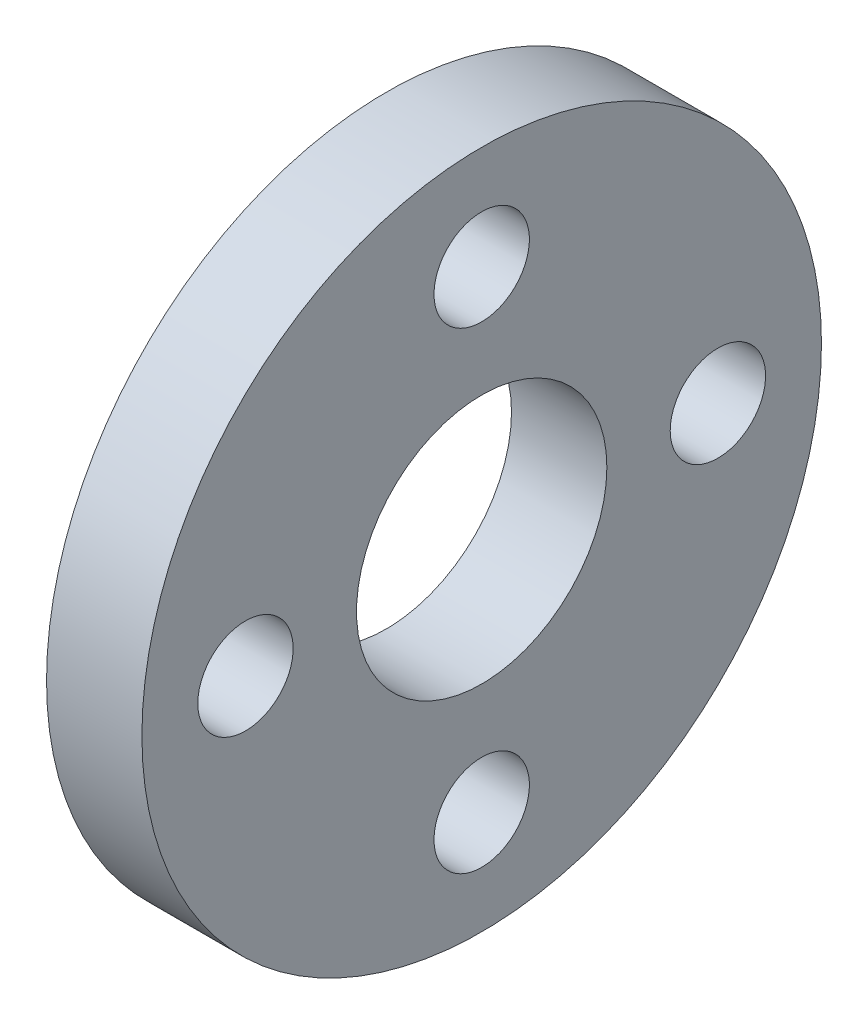
ISO-10303-21;
HEADER;
FILE_DESCRIPTION(('STEP AP214'),'2;1');
FILE_NAME('part.step','',(''),(''),'','','');
FILE_SCHEMA(('AUTOMOTIVE_DESIGN { 1 0 10303 214 1 1 1 1 }'));
ENDSEC;
DATA;
#1=APPLICATION_CONTEXT('core data for automotive mechanical design processes');
#2=APPLICATION_PROTOCOL_DEFINITION('international standard','automotive_design',2000,#1);
#3=PRODUCT_CONTEXT('',#1,'mechanical');
#4=PRODUCT('Part','Part','',(#3));
#5=PRODUCT_RELATED_PRODUCT_CATEGORY('part','',(#4));
#6=PRODUCT_DEFINITION_FORMATION('','',#4);
#7=PRODUCT_DEFINITION_CONTEXT('part definition',#1,'design');
#8=PRODUCT_DEFINITION('design','',#6,#7);
#9=PRODUCT_DEFINITION_SHAPE('','',#8);
#10=(LENGTH_UNIT() NAMED_UNIT(*) SI_UNIT(.MILLI.,.METRE.));
#11=(NAMED_UNIT(*) PLANE_ANGLE_UNIT() SI_UNIT($,.RADIAN.));
#12=(NAMED_UNIT(*) SI_UNIT($,.STERADIAN.) SOLID_ANGLE_UNIT());
#13=UNCERTAINTY_MEASURE_WITH_UNIT(LENGTH_MEASURE(1.E-05),#10,'distance_accuracy_value','');
#14=(GEOMETRIC_REPRESENTATION_CONTEXT(3) GLOBAL_UNCERTAINTY_ASSIGNED_CONTEXT((#13)) GLOBAL_UNIT_ASSIGNED_CONTEXT((#10,
#11,#12)) REPRESENTATION_CONTEXT('',''));
#15=CARTESIAN_POINT('',(0.,0.,0.));
#16=DIRECTION('',(0.,0.,1.));
#17=DIRECTION('',(1.,0.,0.));
#18=AXIS2_PLACEMENT_3D('',#15,#16,#17);
#19=CARTESIAN_POINT('',(16.,0.,39.625));
#20=DIRECTION('',(-1.,0.,0.));
#21=DIRECTION('',(0.,0.,1.));
#22=AXIS2_PLACEMENT_3D('',#19,#20,#21);
#23=CYLINDRICAL_SURFACE('',#22,8.);
#24=CARTESIAN_POINT('',(16.,0.,39.625));
#25=DIRECTION('',(-1.,0.,0.));
#26=DIRECTION('',(0.,0.,1.));
#27=AXIS2_PLACEMENT_3D('',#24,#25,#26);
#28=CIRCLE('',#27,8.);
#29=CARTESIAN_POINT('',(16.,0.,47.625));
#30=VERTEX_POINT('',#29);
#31=EDGE_CURVE('E39',#30,#30,#28,.T.);
#32=ORIENTED_EDGE('',*,*,#31,.F.);
#33=EDGE_LOOP('',(#32));
#34=FACE_BOUND('',#33,.T.);
#35=CARTESIAN_POINT('',(0.,0.,39.625));
#36=DIRECTION('',(-1.,0.,0.));
#37=DIRECTION('',(0.,0.,1.));
#38=AXIS2_PLACEMENT_3D('',#35,#36,#37);
#39=CIRCLE('',#38,8.);
#40=CARTESIAN_POINT('',(0.,0.,47.625));
#41=VERTEX_POINT('',#40);
#42=EDGE_CURVE('E16',#41,#41,#39,.F.);
#43=ORIENTED_EDGE('',*,*,#42,.F.);
#44=EDGE_LOOP('',(#43));
#45=FACE_BOUND('',#44,.T.);
#46=ADVANCED_FACE('F13',(#34,#45),#23,.F.);
#47=CARTESIAN_POINT('',(16.,-39.625,0.));
#48=DIRECTION('',(-1.,0.,0.));
#49=DIRECTION('',(0.,0.,1.));
#50=AXIS2_PLACEMENT_3D('',#47,#48,#49);
#51=CYLINDRICAL_SURFACE('',#50,8.00000000000001);
#52=CARTESIAN_POINT('',(16.,-39.625,0.));
#53=DIRECTION('',(-1.,0.,0.));
#54=DIRECTION('',(0.,0.,1.));
#55=AXIS2_PLACEMENT_3D('',#52,#53,#54);
#56=CIRCLE('',#55,8.00000000000001);
#57=CARTESIAN_POINT('',(16.,-39.625,8.00000000000001));
#58=VERTEX_POINT('',#57);
#59=EDGE_CURVE('E36',#58,#58,#56,.T.);
#60=ORIENTED_EDGE('',*,*,#59,.F.);
#61=EDGE_LOOP('',(#60));
#62=FACE_BOUND('',#61,.T.);
#63=CARTESIAN_POINT('',(0.,-39.625,0.));
#64=DIRECTION('',(-1.,0.,0.));
#65=DIRECTION('',(0.,0.,1.));
#66=AXIS2_PLACEMENT_3D('',#63,#64,#65);
#67=CIRCLE('',#66,8.00000000000001);
#68=CARTESIAN_POINT('',(0.,-39.625,8.00000000000001));
#69=VERTEX_POINT('',#68);
#70=EDGE_CURVE('E50',#69,#69,#67,.F.);
#71=ORIENTED_EDGE('',*,*,#70,.F.);
#72=EDGE_LOOP('',(#71));
#73=FACE_BOUND('',#72,.T.);
#74=ADVANCED_FACE('F61',(#62,#73),#51,.F.);
#75=CARTESIAN_POINT('',(16.,0.,-39.625));
#76=DIRECTION('',(-1.,0.,0.));
#77=DIRECTION('',(0.,0.,1.));
#78=AXIS2_PLACEMENT_3D('',#75,#76,#77);
#79=CYLINDRICAL_SURFACE('',#78,8.);
#80=CARTESIAN_POINT('',(16.,0.,-39.625));
#81=DIRECTION('',(-1.,0.,0.));
#82=DIRECTION('',(0.,0.,1.));
#83=AXIS2_PLACEMENT_3D('',#80,#81,#82);
#84=CIRCLE('',#83,8.);
#85=CARTESIAN_POINT('',(16.,0.,-31.625));
#86=VERTEX_POINT('',#85);
#87=EDGE_CURVE('E33',#86,#86,#84,.T.);
#88=ORIENTED_EDGE('',*,*,#87,.F.);
#89=EDGE_LOOP('',(#88));
#90=FACE_BOUND('',#89,.T.);
#91=CARTESIAN_POINT('',(0.,0.,-39.625));
#92=DIRECTION('',(-1.,0.,0.));
#93=DIRECTION('',(0.,0.,1.));
#94=AXIS2_PLACEMENT_3D('',#91,#92,#93);
#95=CIRCLE('',#94,8.);
#96=CARTESIAN_POINT('',(0.,0.,-31.625));
#97=VERTEX_POINT('',#96);
#98=EDGE_CURVE('E48',#97,#97,#95,.F.);
#99=ORIENTED_EDGE('',*,*,#98,.F.);
#100=EDGE_LOOP('',(#99));
#101=FACE_BOUND('',#100,.T.);
#102=ADVANCED_FACE('F67',(#90,#101),#79,.F.);
#103=CARTESIAN_POINT('',(16.,39.625,0.));
#104=DIRECTION('',(-1.,0.,0.));
#105=DIRECTION('',(0.,0.,1.));
#106=AXIS2_PLACEMENT_3D('',#103,#104,#105);
#107=CYLINDRICAL_SURFACE('',#106,8.);
#108=CARTESIAN_POINT('',(16.,39.625,0.));
#109=DIRECTION('',(-1.,0.,0.));
#110=DIRECTION('',(0.,0.,1.));
#111=AXIS2_PLACEMENT_3D('',#108,#109,#110);
#112=CIRCLE('',#111,8.);
#113=CARTESIAN_POINT('',(16.,39.625,8.));
#114=VERTEX_POINT('',#113);
#115=EDGE_CURVE('E30',#114,#114,#112,.T.);
#116=ORIENTED_EDGE('',*,*,#115,.F.);
#117=EDGE_LOOP('',(#116));
#118=FACE_BOUND('',#117,.T.);
#119=CARTESIAN_POINT('',(0.,39.625,0.));
#120=DIRECTION('',(-1.,0.,0.));
#121=DIRECTION('',(0.,0.,1.));
#122=AXIS2_PLACEMENT_3D('',#119,#120,#121);
#123=CIRCLE('',#122,8.);
#124=CARTESIAN_POINT('',(0.,39.625,8.));
#125=VERTEX_POINT('',#124);
#126=EDGE_CURVE('E45',#125,#125,#123,.F.);
#127=ORIENTED_EDGE('',*,*,#126,.F.);
#128=EDGE_LOOP('',(#127));
#129=FACE_BOUND('',#128,.T.);
#130=ADVANCED_FACE('F87',(#118,#129),#107,.F.);
#131=CARTESIAN_POINT('',(0.,0.,0.));
#132=DIRECTION('',(1.,0.,0.));
#133=DIRECTION('',(0.,0.,-1.));
#134=AXIS2_PLACEMENT_3D('',#131,#132,#133);
#135=CYLINDRICAL_SURFACE('',#134,21.);
#136=CARTESIAN_POINT('',(0.,0.,0.));
#137=DIRECTION('',(1.,0.,0.));
#138=DIRECTION('',(0.,0.,-1.));
#139=AXIS2_PLACEMENT_3D('',#136,#137,#138);
#140=CIRCLE('',#139,21.);
#141=CARTESIAN_POINT('',(0.,0.,-21.));
#142=VERTEX_POINT('',#141);
#143=EDGE_CURVE('E42',#142,#142,#140,.T.);
#144=ORIENTED_EDGE('',*,*,#143,.F.);
#145=EDGE_LOOP('',(#144));
#146=FACE_BOUND('',#145,.T.);
#147=CARTESIAN_POINT('',(16.,0.,0.));
#148=DIRECTION('',(1.,0.,0.));
#149=DIRECTION('',(0.,0.,-1.));
#150=AXIS2_PLACEMENT_3D('',#147,#148,#149);
#151=CIRCLE('',#150,21.);
#152=CARTESIAN_POINT('',(16.,0.,-21.));
#153=VERTEX_POINT('',#152);
#154=EDGE_CURVE('E25',#153,#153,#151,.F.);
#155=ORIENTED_EDGE('',*,*,#154,.F.);
#156=EDGE_LOOP('',(#155));
#157=FACE_BOUND('',#156,.T.);
#158=ADVANCED_FACE('F83',(#146,#157),#135,.F.);
#159=CARTESIAN_POINT('',(0.,-57.6840021080977,-57.));
#160=DIRECTION('',(-1.,0.,0.));
#161=DIRECTION('',(0.,0.,1.));
#162=AXIS2_PLACEMENT_3D('',#159,#160,#161);
#163=PLANE('',#162);
#164=ORIENTED_EDGE('',*,*,#143,.T.);
#165=EDGE_LOOP('',(#164));
#166=FACE_BOUND('',#165,.T.);
#167=ORIENTED_EDGE('',*,*,#126,.T.);
#168=EDGE_LOOP('',(#167));
#169=FACE_BOUND('',#168,.T.);
#170=ORIENTED_EDGE('',*,*,#98,.T.);
#171=EDGE_LOOP('',(#170));
#172=FACE_BOUND('',#171,.T.);
#173=ORIENTED_EDGE('',*,*,#70,.T.);
#174=EDGE_LOOP('',(#173));
#175=FACE_BOUND('',#174,.T.);
#176=ORIENTED_EDGE('',*,*,#42,.T.);
#177=EDGE_LOOP('',(#176));
#178=FACE_BOUND('',#177,.T.);
#179=CARTESIAN_POINT('',(0.,0.,0.));
#180=DIRECTION('',(1.,0.,0.));
#181=DIRECTION('',(0.,0.,-1.));
#182=AXIS2_PLACEMENT_3D('',#179,#180,#181);
#183=CIRCLE('',#182,57.);
#184=CARTESIAN_POINT('',(0.,0.,-57.));
#185=VERTEX_POINT('',#184);
#186=EDGE_CURVE('E20',#185,#185,#183,.T.);
#187=ORIENTED_EDGE('',*,*,#186,.F.);
#188=EDGE_LOOP('',(#187));
#189=FACE_BOUND('',#188,.T.);
#190=ADVANCED_FACE('F57',(#166,#169,#172,#175,#178,#189),#163,.T.);
#191=CARTESIAN_POINT('',(16.,-57.6840021080977,57.));
#192=DIRECTION('',(1.,0.,0.));
#193=DIRECTION('',(0.,0.,-1.));
#194=AXIS2_PLACEMENT_3D('',#191,#192,#193);
#195=PLANE('',#194);
#196=ORIENTED_EDGE('',*,*,#154,.T.);
#197=EDGE_LOOP('',(#196));
#198=FACE_BOUND('',#197,.T.);
#199=ORIENTED_EDGE('',*,*,#115,.T.);
#200=EDGE_LOOP('',(#199));
#201=FACE_BOUND('',#200,.T.);
#202=ORIENTED_EDGE('',*,*,#87,.T.);
#203=EDGE_LOOP('',(#202));
#204=FACE_BOUND('',#203,.T.);
#205=ORIENTED_EDGE('',*,*,#59,.T.);
#206=EDGE_LOOP('',(#205));
#207=FACE_BOUND('',#206,.T.);
#208=ORIENTED_EDGE('',*,*,#31,.T.);
#209=EDGE_LOOP('',(#208));
#210=FACE_BOUND('',#209,.T.);
#211=CARTESIAN_POINT('',(16.,0.,0.));
#212=DIRECTION('',(1.,0.,0.));
#213=DIRECTION('',(0.,0.,-1.));
#214=AXIS2_PLACEMENT_3D('',#211,#212,#213);
#215=CIRCLE('',#214,57.);
#216=CARTESIAN_POINT('',(16.,0.,-57.));
#217=VERTEX_POINT('',#216);
#218=EDGE_CURVE('E8',#217,#217,#215,.F.);
#219=ORIENTED_EDGE('',*,*,#218,.F.);
#220=EDGE_LOOP('',(#219));
#221=FACE_BOUND('',#220,.T.);
#222=ADVANCED_FACE('F72',(#198,#201,#204,#207,#210,#221),#195,.T.);
#223=CARTESIAN_POINT('',(16.,0.,0.));
#224=DIRECTION('',(1.,0.,0.));
#225=DIRECTION('',(0.,0.,-1.));
#226=AXIS2_PLACEMENT_3D('',#223,#224,#225);
#227=CYLINDRICAL_SURFACE('',#226,57.);
#228=ORIENTED_EDGE('',*,*,#186,.T.);
#229=EDGE_LOOP('',(#228));
#230=FACE_BOUND('',#229,.T.);
#231=ORIENTED_EDGE('',*,*,#218,.T.);
#232=EDGE_LOOP('',(#231));
#233=FACE_BOUND('',#232,.T.);
#234=ADVANCED_FACE('F70',(#230,#233),#227,.T.);
#235=CLOSED_SHELL('',(#46,#74,#102,#130,#158,#190,#222,#234));
#236=MANIFOLD_SOLID_BREP('B1',#235);
#237=ADVANCED_BREP_SHAPE_REPRESENTATION('',(#18,#236),#14);
#238=SHAPE_DEFINITION_REPRESENTATION(#9,#237);
ENDSEC;
END-ISO-10303-21;
